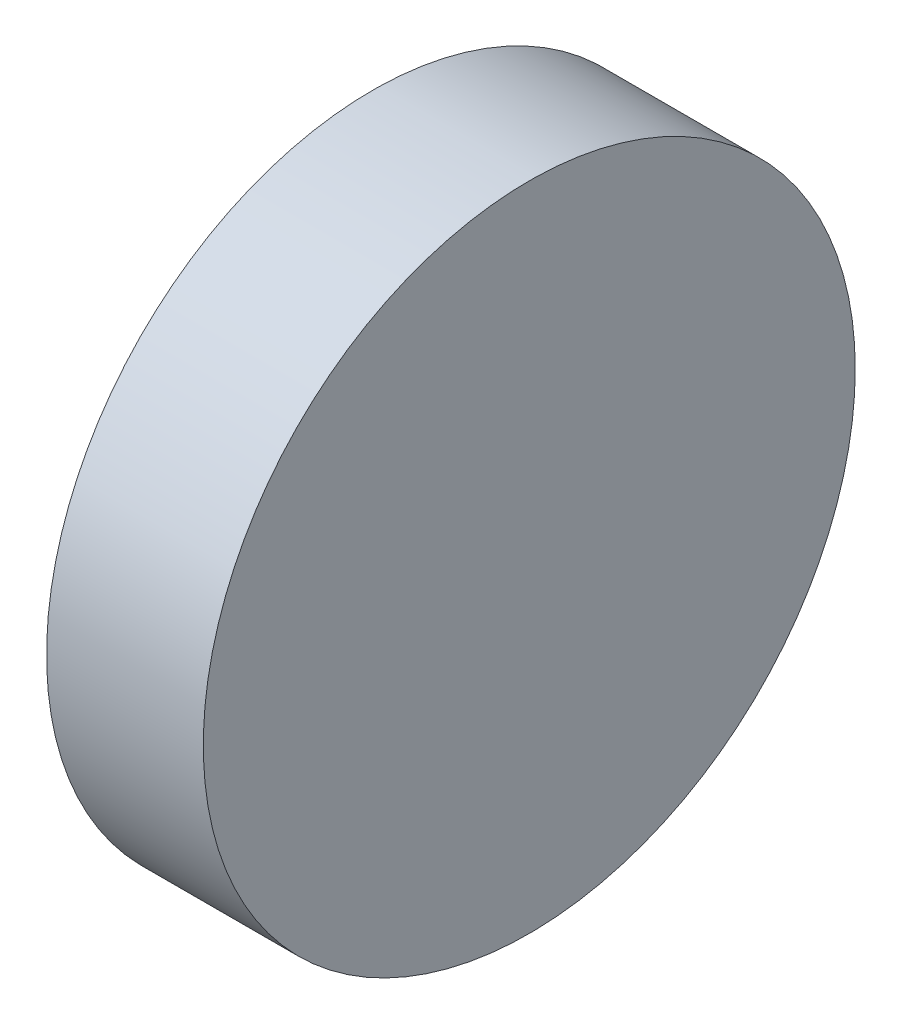
ISO-10303-21;
HEADER;
FILE_DESCRIPTION(('STEP AP214'),'2;1');
FILE_NAME('part.step','',(''),(''),'','','');
FILE_SCHEMA(('AUTOMOTIVE_DESIGN { 1 0 10303 214 1 1 1 1 }'));
ENDSEC;
DATA;
#1=APPLICATION_CONTEXT('core data for automotive mechanical design processes');
#2=APPLICATION_PROTOCOL_DEFINITION('international standard','automotive_design',2000,#1);
#3=PRODUCT_CONTEXT('',#1,'mechanical');
#4=PRODUCT('Part','Part','',(#3));
#5=PRODUCT_RELATED_PRODUCT_CATEGORY('part','',(#4));
#6=PRODUCT_DEFINITION_FORMATION('','',#4);
#7=PRODUCT_DEFINITION_CONTEXT('part definition',#1,'design');
#8=PRODUCT_DEFINITION('design','',#6,#7);
#9=PRODUCT_DEFINITION_SHAPE('','',#8);
#10=(LENGTH_UNIT() NAMED_UNIT(*) SI_UNIT(.MILLI.,.METRE.));
#11=(NAMED_UNIT(*) PLANE_ANGLE_UNIT() SI_UNIT($,.RADIAN.));
#12=(NAMED_UNIT(*) SI_UNIT($,.STERADIAN.) SOLID_ANGLE_UNIT());
#13=UNCERTAINTY_MEASURE_WITH_UNIT(LENGTH_MEASURE(1.E-05),#10,'distance_accuracy_value','');
#14=(GEOMETRIC_REPRESENTATION_CONTEXT(3) GLOBAL_UNCERTAINTY_ASSIGNED_CONTEXT((#13)) GLOBAL_UNIT_ASSIGNED_CONTEXT((#10,
#11,#12)) REPRESENTATION_CONTEXT('',''));
#15=CARTESIAN_POINT('',(0.,0.,0.));
#16=DIRECTION('',(0.,0.,1.));
#17=DIRECTION('',(1.,0.,0.));
#18=AXIS2_PLACEMENT_3D('',#15,#16,#17);
#19=CARTESIAN_POINT('',(10.,0.,0.));
#20=DIRECTION('',(-1.,0.,0.));
#21=DIRECTION('',(0.,0.,1.));
#22=AXIS2_PLACEMENT_3D('',#19,#20,#21);
#23=CYLINDRICAL_SURFACE('',#22,41.5969617023607);
#24=CARTESIAN_POINT('',(10.,0.,0.));
#25=DIRECTION('',(1.,0.,0.));
#26=DIRECTION('',(0.,0.,-1.));
#27=AXIS2_PLACEMENT_3D('',#24,#25,#26);
#28=CIRCLE('',#27,41.5969617023607);
#29=CARTESIAN_POINT('',(10.,0.,-41.5969617023607));
#30=VERTEX_POINT('',#29);
#31=EDGE_CURVE('E10',#30,#30,#28,.T.);
#32=ORIENTED_EDGE('',*,*,#31,.F.);
#33=EDGE_LOOP('',(#32));
#34=FACE_BOUND('',#33,.T.);
#35=CARTESIAN_POINT('',(-10.,0.,0.));
#36=DIRECTION('',(1.,0.,0.));
#37=DIRECTION('',(0.,0.,-1.));
#38=AXIS2_PLACEMENT_3D('',#35,#36,#37);
#39=CIRCLE('',#38,41.5969617023607);
#40=CARTESIAN_POINT('',(-10.,0.,-41.5969617023607));
#41=VERTEX_POINT('',#40);
#42=EDGE_CURVE('E44',#41,#41,#39,.T.);
#43=ORIENTED_EDGE('',*,*,#42,.T.);
#44=EDGE_LOOP('',(#43));
#45=FACE_BOUND('',#44,.T.);
#46=ADVANCED_FACE('F41',(#34,#45),#23,.T.);
#47=CARTESIAN_POINT('',(10.,0.,0.));
#48=DIRECTION('',(1.,0.,0.));
#49=DIRECTION('',(0.,0.,-1.));
#50=AXIS2_PLACEMENT_3D('',#47,#48,#49);
#51=PLANE('',#50);
#52=ORIENTED_EDGE('',*,*,#31,.T.);
#53=EDGE_LOOP('',(#52));
#54=FACE_BOUND('',#53,.T.);
#55=ADVANCED_FACE('F56',(#54),#51,.T.);
#56=CARTESIAN_POINT('',(-10.,0.,0.));
#57=DIRECTION('',(1.,0.,0.));
#58=DIRECTION('',(0.,0.,-1.));
#59=AXIS2_PLACEMENT_3D('',#56,#57,#58);
#60=PLANE('',#59);
#61=ORIENTED_EDGE('',*,*,#42,.F.);
#62=EDGE_LOOP('',(#61));
#63=FACE_BOUND('',#62,.T.);
#64=ADVANCED_FACE('F54',(#63),#60,.F.);
#65=CLOSED_SHELL('',(#46,#55,#64));
#66=MANIFOLD_SOLID_BREP('B2',#65);
#67=ADVANCED_BREP_SHAPE_REPRESENTATION('',(#18,#66),#14);
#68=SHAPE_DEFINITION_REPRESENTATION(#9,#67);
ENDSEC;
END-ISO-10303-21;
